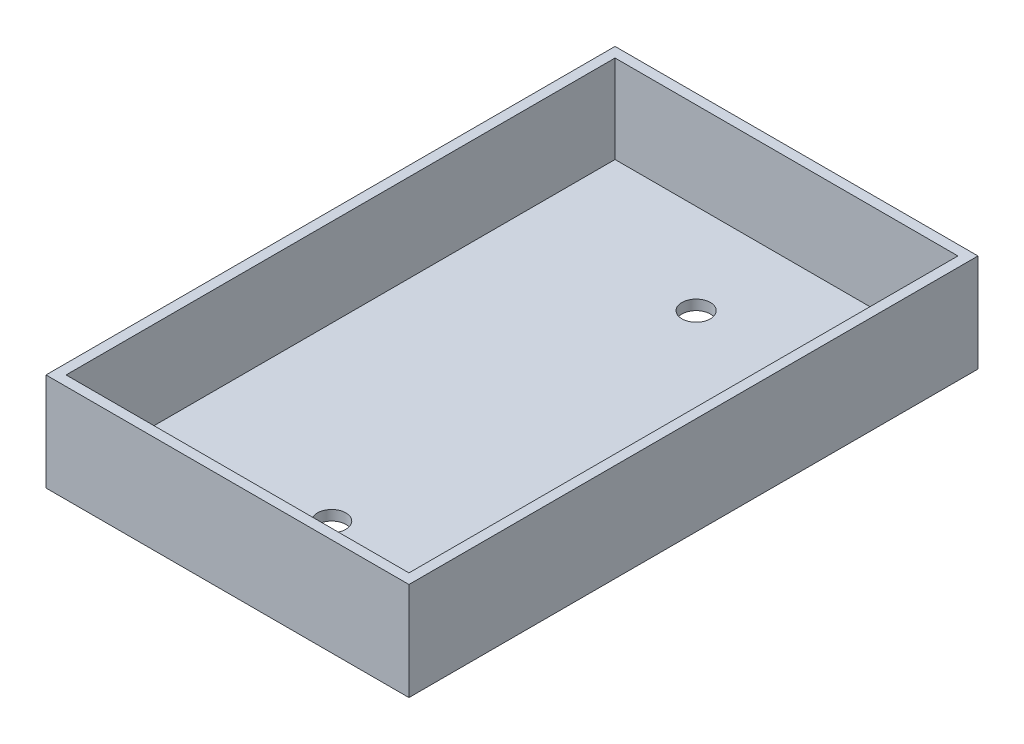
ISO-10303-21;
HEADER;
FILE_DESCRIPTION(('STEP AP214'),'2;1');
FILE_NAME('part.step','',(''),(''),'','','');
FILE_SCHEMA(('AUTOMOTIVE_DESIGN { 1 0 10303 214 1 1 1 1 }'));
ENDSEC;
DATA;
#1=APPLICATION_CONTEXT('core data for automotive mechanical design processes');
#2=APPLICATION_PROTOCOL_DEFINITION('international standard','automotive_design',2000,#1);
#3=PRODUCT_CONTEXT('',#1,'mechanical');
#4=PRODUCT('Part','Part','',(#3));
#5=PRODUCT_RELATED_PRODUCT_CATEGORY('part','',(#4));
#6=PRODUCT_DEFINITION_FORMATION('','',#4);
#7=PRODUCT_DEFINITION_CONTEXT('part definition',#1,'design');
#8=PRODUCT_DEFINITION('design','',#6,#7);
#9=PRODUCT_DEFINITION_SHAPE('','',#8);
#10=(LENGTH_UNIT() NAMED_UNIT(*) SI_UNIT(.MILLI.,.METRE.));
#11=(NAMED_UNIT(*) PLANE_ANGLE_UNIT() SI_UNIT($,.RADIAN.));
#12=(NAMED_UNIT(*) SI_UNIT($,.STERADIAN.) SOLID_ANGLE_UNIT());
#13=UNCERTAINTY_MEASURE_WITH_UNIT(LENGTH_MEASURE(1.E-05),#10,'distance_accuracy_value','');
#14=(GEOMETRIC_REPRESENTATION_CONTEXT(3) GLOBAL_UNCERTAINTY_ASSIGNED_CONTEXT((#13)) GLOBAL_UNIT_ASSIGNED_CONTEXT((#10,
#11,#12)) REPRESENTATION_CONTEXT('',''));
#15=CARTESIAN_POINT('',(0.,0.,0.));
#16=DIRECTION('',(0.,0.,1.));
#17=DIRECTION('',(1.,0.,0.));
#18=AXIS2_PLACEMENT_3D('',#15,#16,#17);
#19=CARTESIAN_POINT('',(0.,1.5875,0.));
#20=DIRECTION('',(0.,1.,0.));
#21=DIRECTION('',(0.,0.,1.));
#22=AXIS2_PLACEMENT_3D('',#19,#20,#21);
#23=PLANE('',#22);
#24=CARTESIAN_POINT('',(28.702,1.5875,73.5203));
#25=DIRECTION('',(0.,1.,0.));
#26=DIRECTION('',(0.,0.,1.));
#27=AXIS2_PLACEMENT_3D('',#24,#25,#26);
#28=CIRCLE('',#27,2.2479);
#29=CARTESIAN_POINT('',(28.702,1.5875,75.7682));
#30=VERTEX_POINT('',#29);
#31=EDGE_CURVE('E230',#30,#30,#28,.T.);
#32=ORIENTED_EDGE('',*,*,#31,.F.);
#33=EDGE_LOOP('',(#32));
#34=FACE_BOUND('',#33,.T.);
#35=CARTESIAN_POINT('',(28.702,1.5875,15.875));
#36=DIRECTION('',(0.,1.,0.));
#37=DIRECTION('',(0.,0.,1.));
#38=AXIS2_PLACEMENT_3D('',#35,#36,#37);
#39=CIRCLE('',#38,2.2479);
#40=CARTESIAN_POINT('',(28.702,1.5875,18.1229));
#41=VERTEX_POINT('',#40);
#42=EDGE_CURVE('E232',#41,#41,#39,.T.);
#43=ORIENTED_EDGE('',*,*,#42,.F.);
#44=EDGE_LOOP('',(#43));
#45=FACE_BOUND('',#44,.T.);
#46=DIRECTION('',(1.,0.,0.));
#47=VECTOR('',#46,1.);
#48=CARTESIAN_POINT('',(-13.996817441833,1.5875,1.58750000000001));
#49=LINE('',#48,#47);
#50=CARTESIAN_POINT('',(1.5875,1.5875,1.58750000000001));
#51=VERTEX_POINT('',#50);
#52=CARTESIAN_POINT('',(55.8165,1.5875,1.58750000000002));
#53=VERTEX_POINT('',#52);
#54=EDGE_CURVE('E151',#51,#53,#49,.T.);
#55=ORIENTED_EDGE('',*,*,#54,.F.);
#56=DIRECTION('',(0.,0.,1.));
#57=VECTOR('',#56,1.);
#58=CARTESIAN_POINT('',(1.5875,1.5875,0.));
#59=LINE('',#58,#57);
#60=CARTESIAN_POINT('',(1.58750000000001,1.5875,88.4125));
#61=VERTEX_POINT('',#60);
#62=EDGE_CURVE('E126',#51,#61,#59,.T.);
#63=ORIENTED_EDGE('',*,*,#62,.T.);
#64=DIRECTION('',(1.,0.,0.));
#65=VECTOR('',#64,1.);
#66=CARTESIAN_POINT('',(-13.996817441833,1.5875,88.4125));
#67=LINE('',#66,#65);
#68=CARTESIAN_POINT('',(55.8165,1.5875,88.4125));
#69=VERTEX_POINT('',#68);
#70=EDGE_CURVE('E140',#61,#69,#67,.T.);
#71=ORIENTED_EDGE('',*,*,#70,.T.);
#72=DIRECTION('',(0.,0.,-1.));
#73=VECTOR('',#72,1.);
#74=CARTESIAN_POINT('',(55.8165,1.5875,90.));
#75=LINE('',#74,#73);
#76=EDGE_CURVE('E63',#69,#53,#75,.T.);
#77=ORIENTED_EDGE('',*,*,#76,.T.);
#78=EDGE_LOOP('',(#55,#63,#71,#77));
#79=FACE_BOUND('',#78,.T.);
#80=ADVANCED_FACE('F41',(#34,#45,#79),#23,.T.);
#81=CARTESIAN_POINT('',(0.,1.5875,0.));
#82=DIRECTION('',(1.,0.,0.));
#83=DIRECTION('',(0.,0.,-1.));
#84=AXIS2_PLACEMENT_3D('',#81,#82,#83);
#85=PLANE('',#84);
#86=DIRECTION('',(0.,0.,1.));
#87=VECTOR('',#86,1.);
#88=CARTESIAN_POINT('',(0.,0.,0.));
#89=LINE('',#88,#87);
#90=CARTESIAN_POINT('',(0.,0.,0.));
#91=VERTEX_POINT('',#90);
#92=CARTESIAN_POINT('',(0.,0.,90.));
#93=VERTEX_POINT('',#92);
#94=EDGE_CURVE('E112',#91,#93,#89,.T.);
#95=ORIENTED_EDGE('',*,*,#94,.T.);
#96=DIRECTION('',(0.,-1.,0.));
#97=VECTOR('',#96,1.);
#98=CARTESIAN_POINT('',(0.,1.5875,90.));
#99=LINE('',#98,#97);
#100=CARTESIAN_POINT('',(0.,15.494,90.));
#101=VERTEX_POINT('',#100);
#102=EDGE_CURVE('E12',#101,#93,#99,.T.);
#103=ORIENTED_EDGE('',*,*,#102,.F.);
#104=DIRECTION('',(0.,0.,-1.));
#105=VECTOR('',#104,1.);
#106=CARTESIAN_POINT('',(0.,15.494,90.));
#107=LINE('',#106,#105);
#108=CARTESIAN_POINT('',(0.,15.494,0.));
#109=VERTEX_POINT('',#108);
#110=EDGE_CURVE('E110',#101,#109,#107,.T.);
#111=ORIENTED_EDGE('',*,*,#110,.T.);
#112=DIRECTION('',(0.,-1.,0.));
#113=VECTOR('',#112,1.);
#114=CARTESIAN_POINT('',(0.,1.5875,0.));
#115=LINE('',#114,#113);
#116=EDGE_CURVE('E168',#109,#91,#115,.T.);
#117=ORIENTED_EDGE('',*,*,#116,.T.);
#118=EDGE_LOOP('',(#95,#103,#111,#117));
#119=FACE_BOUND('',#118,.T.);
#120=ADVANCED_FACE('F43',(#119),#85,.F.);
#121=CARTESIAN_POINT('',(0.,1.5875,90.));
#122=DIRECTION('',(0.,0.,-1.));
#123=DIRECTION('',(-1.,0.,0.));
#124=AXIS2_PLACEMENT_3D('',#121,#122,#123);
#125=PLANE('',#124);
#126=DIRECTION('',(1.,0.,0.));
#127=VECTOR('',#126,1.);
#128=CARTESIAN_POINT('',(0.,0.,90.));
#129=LINE('',#128,#127);
#130=CARTESIAN_POINT('',(57.404,0.,90.));
#131=VERTEX_POINT('',#130);
#132=EDGE_CURVE('E162',#93,#131,#129,.T.);
#133=ORIENTED_EDGE('',*,*,#132,.T.);
#134=DIRECTION('',(0.,-1.,0.));
#135=VECTOR('',#134,1.);
#136=CARTESIAN_POINT('',(57.404,1.5875,90.));
#137=LINE('',#136,#135);
#138=CARTESIAN_POINT('',(57.404,15.494,90.));
#139=VERTEX_POINT('',#138);
#140=EDGE_CURVE('E49',#139,#131,#137,.T.);
#141=ORIENTED_EDGE('',*,*,#140,.F.);
#142=DIRECTION('',(1.,0.,0.));
#143=VECTOR('',#142,1.);
#144=CARTESIAN_POINT('',(55.8165,15.494,90.));
#145=LINE('',#144,#143);
#146=EDGE_CURVE('E115',#101,#139,#145,.T.);
#147=ORIENTED_EDGE('',*,*,#146,.F.);
#148=ORIENTED_EDGE('',*,*,#102,.T.);
#149=EDGE_LOOP('',(#133,#141,#147,#148));
#150=FACE_BOUND('',#149,.T.);
#151=ADVANCED_FACE('F116',(#150),#125,.F.);
#152=CARTESIAN_POINT('',(57.404,1.5875,0.));
#153=DIRECTION('',(-1.,0.,0.));
#154=DIRECTION('',(0.,0.,1.));
#155=AXIS2_PLACEMENT_3D('',#152,#153,#154);
#156=PLANE('',#155);
#157=DIRECTION('',(0.,0.,-1.));
#158=VECTOR('',#157,1.);
#159=CARTESIAN_POINT('',(57.404,0.,0.));
#160=LINE('',#159,#158);
#161=CARTESIAN_POINT('',(57.404,0.,0.));
#162=VERTEX_POINT('',#161);
#163=EDGE_CURVE('E164',#131,#162,#160,.T.);
#164=ORIENTED_EDGE('',*,*,#163,.T.);
#165=DIRECTION('',(0.,-1.,0.));
#166=VECTOR('',#165,1.);
#167=CARTESIAN_POINT('',(57.404,1.5875,0.));
#168=LINE('',#167,#166);
#169=CARTESIAN_POINT('',(57.404,15.494,0.));
#170=VERTEX_POINT('',#169);
#171=EDGE_CURVE('E170',#170,#162,#168,.T.);
#172=ORIENTED_EDGE('',*,*,#171,.F.);
#173=DIRECTION('',(0.,0.,1.));
#174=VECTOR('',#173,1.);
#175=CARTESIAN_POINT('',(57.404,15.494,90.));
#176=LINE('',#175,#174);
#177=EDGE_CURVE('E148',#170,#139,#176,.T.);
#178=ORIENTED_EDGE('',*,*,#177,.T.);
#179=ORIENTED_EDGE('',*,*,#140,.T.);
#180=EDGE_LOOP('',(#164,#172,#178,#179));
#181=FACE_BOUND('',#180,.T.);
#182=ADVANCED_FACE('F174',(#181),#156,.F.);
#183=CARTESIAN_POINT('',(0.,1.5875,0.));
#184=DIRECTION('',(0.,0.,1.));
#185=DIRECTION('',(1.,0.,0.));
#186=AXIS2_PLACEMENT_3D('',#183,#184,#185);
#187=PLANE('',#186);
#188=ORIENTED_EDGE('',*,*,#116,.F.);
#189=DIRECTION('',(1.,0.,0.));
#190=VECTOR('',#189,1.);
#191=CARTESIAN_POINT('',(55.8165,15.494,0.));
#192=LINE('',#191,#190);
#193=EDGE_CURVE('E121',#109,#170,#192,.T.);
#194=ORIENTED_EDGE('',*,*,#193,.T.);
#195=ORIENTED_EDGE('',*,*,#171,.T.);
#196=DIRECTION('',(-1.,0.,0.));
#197=VECTOR('',#196,1.);
#198=CARTESIAN_POINT('',(0.,0.,0.));
#199=LINE('',#198,#197);
#200=EDGE_CURVE('E166',#162,#91,#199,.T.);
#201=ORIENTED_EDGE('',*,*,#200,.T.);
#202=EDGE_LOOP('',(#188,#194,#195,#201));
#203=FACE_BOUND('',#202,.T.);
#204=ADVANCED_FACE('F179',(#203),#187,.F.);
#205=CARTESIAN_POINT('',(0.,0.,0.));
#206=DIRECTION('',(0.,1.,0.));
#207=DIRECTION('',(0.,0.,1.));
#208=AXIS2_PLACEMENT_3D('',#205,#206,#207);
#209=PLANE('',#208);
#210=CARTESIAN_POINT('',(28.702,0.,73.5203));
#211=DIRECTION('',(0.,1.,0.));
#212=DIRECTION('',(0.,0.,1.));
#213=AXIS2_PLACEMENT_3D('',#210,#211,#212);
#214=CIRCLE('',#213,2.2479);
#215=CARTESIAN_POINT('',(28.702,0.,75.7682));
#216=VERTEX_POINT('',#215);
#217=EDGE_CURVE('E228',#216,#216,#214,.T.);
#218=ORIENTED_EDGE('',*,*,#217,.T.);
#219=EDGE_LOOP('',(#218));
#220=FACE_BOUND('',#219,.T.);
#221=CARTESIAN_POINT('',(28.702,0.,15.875));
#222=DIRECTION('',(0.,1.,0.));
#223=DIRECTION('',(0.,0.,1.));
#224=AXIS2_PLACEMENT_3D('',#221,#222,#223);
#225=CIRCLE('',#224,2.2479);
#226=CARTESIAN_POINT('',(28.702,0.,18.1229));
#227=VERTEX_POINT('',#226);
#228=EDGE_CURVE('E132',#227,#227,#225,.T.);
#229=ORIENTED_EDGE('',*,*,#228,.T.);
#230=EDGE_LOOP('',(#229));
#231=FACE_BOUND('',#230,.T.);
#232=ORIENTED_EDGE('',*,*,#94,.F.);
#233=ORIENTED_EDGE('',*,*,#200,.F.);
#234=ORIENTED_EDGE('',*,*,#163,.F.);
#235=ORIENTED_EDGE('',*,*,#132,.F.);
#236=EDGE_LOOP('',(#232,#233,#234,#235));
#237=FACE_BOUND('',#236,.T.);
#238=ADVANCED_FACE('F177',(#220,#231,#237),#209,.F.);
#239=CARTESIAN_POINT('',(55.8165,15.494,90.));
#240=DIRECTION('',(0.,1.,0.));
#241=DIRECTION('',(0.,0.,1.));
#242=AXIS2_PLACEMENT_3D('',#239,#240,#241);
#243=PLANE('',#242);
#244=DIRECTION('',(0.,0.,-1.));
#245=VECTOR('',#244,1.);
#246=CARTESIAN_POINT('',(1.58750000000001,15.494,90.));
#247=LINE('',#246,#245);
#248=CARTESIAN_POINT('',(1.58750000000001,15.494,88.4125));
#249=VERTEX_POINT('',#248);
#250=CARTESIAN_POINT('',(1.5875,15.494,1.58750000000005));
#251=VERTEX_POINT('',#250);
#252=EDGE_CURVE('E127',#249,#251,#247,.T.);
#253=ORIENTED_EDGE('',*,*,#252,.T.);
#254=DIRECTION('',(1.,0.,0.));
#255=VECTOR('',#254,1.);
#256=CARTESIAN_POINT('',(-13.996817441833,15.494,1.58750000000001));
#257=LINE('',#256,#255);
#258=CARTESIAN_POINT('',(55.8165,15.494,1.5875));
#259=VERTEX_POINT('',#258);
#260=EDGE_CURVE('E149',#251,#259,#257,.T.);
#261=ORIENTED_EDGE('',*,*,#260,.T.);
#262=DIRECTION('',(0.,0.,1.));
#263=VECTOR('',#262,1.);
#264=CARTESIAN_POINT('',(55.8165,15.494,90.));
#265=LINE('',#264,#263);
#266=CARTESIAN_POINT('',(55.8165,15.494,88.4125));
#267=VERTEX_POINT('',#266);
#268=EDGE_CURVE('E157',#259,#267,#265,.T.);
#269=ORIENTED_EDGE('',*,*,#268,.T.);
#270=DIRECTION('',(1.,0.,0.));
#271=VECTOR('',#270,1.);
#272=CARTESIAN_POINT('',(-13.996817441833,15.494,88.4125));
#273=LINE('',#272,#271);
#274=EDGE_CURVE('E142',#249,#267,#273,.T.);
#275=ORIENTED_EDGE('',*,*,#274,.F.);
#276=EDGE_LOOP('',(#253,#261,#269,#275));
#277=FACE_BOUND('',#276,.T.);
#278=ORIENTED_EDGE('',*,*,#177,.F.);
#279=ORIENTED_EDGE('',*,*,#193,.F.);
#280=ORIENTED_EDGE('',*,*,#110,.F.);
#281=ORIENTED_EDGE('',*,*,#146,.T.);
#282=EDGE_LOOP('',(#278,#279,#280,#281));
#283=FACE_BOUND('',#282,.T.);
#284=ADVANCED_FACE('F124',(#277,#283),#243,.T.);
#285=CARTESIAN_POINT('',(55.8165,0.,0.));
#286=DIRECTION('',(-1.,0.,0.));
#287=DIRECTION('',(0.,0.,1.));
#288=AXIS2_PLACEMENT_3D('',#285,#286,#287);
#289=PLANE('',#288);
#290=DIRECTION('',(0.,1.,0.));
#291=VECTOR('',#290,1.);
#292=CARTESIAN_POINT('',(55.8165,0.,88.4125));
#293=LINE('',#292,#291);
#294=EDGE_CURVE('E56',#69,#267,#293,.T.);
#295=ORIENTED_EDGE('',*,*,#294,.T.);
#296=ORIENTED_EDGE('',*,*,#268,.F.);
#297=DIRECTION('',(0.,-1.,0.));
#298=VECTOR('',#297,1.);
#299=CARTESIAN_POINT('',(55.8165,0.,1.5875));
#300=LINE('',#299,#298);
#301=EDGE_CURVE('E139',#259,#53,#300,.T.);
#302=ORIENTED_EDGE('',*,*,#301,.T.);
#303=ORIENTED_EDGE('',*,*,#76,.F.);
#304=EDGE_LOOP('',(#295,#296,#302,#303));
#305=FACE_BOUND('',#304,.T.);
#306=ADVANCED_FACE('F200',(#305),#289,.T.);
#307=CARTESIAN_POINT('',(-13.996817441833,0.,1.58750000000002));
#308=DIRECTION('',(0.,0.,1.));
#309=DIRECTION('',(0.,-1.,0.));
#310=AXIS2_PLACEMENT_3D('',#307,#308,#309);
#311=PLANE('',#310);
#312=DIRECTION('',(0.,1.,0.));
#313=VECTOR('',#312,1.);
#314=CARTESIAN_POINT('',(1.5875,0.,1.58750000000001));
#315=LINE('',#314,#313);
#316=EDGE_CURVE('E146',#51,#251,#315,.T.);
#317=ORIENTED_EDGE('',*,*,#316,.F.);
#318=ORIENTED_EDGE('',*,*,#54,.T.);
#319=ORIENTED_EDGE('',*,*,#301,.F.);
#320=ORIENTED_EDGE('',*,*,#260,.F.);
#321=EDGE_LOOP('',(#317,#318,#319,#320));
#322=FACE_BOUND('',#321,.T.);
#323=ADVANCED_FACE('F204',(#322),#311,.T.);
#324=CARTESIAN_POINT('',(-13.996817441833,0.,88.4125));
#325=DIRECTION('',(0.,0.,-1.));
#326=DIRECTION('',(-1.,0.,0.));
#327=AXIS2_PLACEMENT_3D('',#324,#325,#326);
#328=PLANE('',#327);
#329=DIRECTION('',(0.,-1.,0.));
#330=VECTOR('',#329,1.);
#331=CARTESIAN_POINT('',(1.58750000000001,0.,88.4125));
#332=LINE('',#331,#330);
#333=EDGE_CURVE('E137',#249,#61,#332,.T.);
#334=ORIENTED_EDGE('',*,*,#333,.F.);
#335=ORIENTED_EDGE('',*,*,#274,.T.);
#336=ORIENTED_EDGE('',*,*,#294,.F.);
#337=ORIENTED_EDGE('',*,*,#70,.F.);
#338=EDGE_LOOP('',(#334,#335,#336,#337));
#339=FACE_BOUND('',#338,.T.);
#340=ADVANCED_FACE('F207',(#339),#328,.T.);
#341=CARTESIAN_POINT('',(1.5875,0.,0.));
#342=DIRECTION('',(-1.,0.,0.));
#343=DIRECTION('',(0.,0.,1.));
#344=AXIS2_PLACEMENT_3D('',#341,#342,#343);
#345=PLANE('',#344);
#346=ORIENTED_EDGE('',*,*,#62,.F.);
#347=ORIENTED_EDGE('',*,*,#316,.T.);
#348=ORIENTED_EDGE('',*,*,#252,.F.);
#349=ORIENTED_EDGE('',*,*,#333,.T.);
#350=EDGE_LOOP('',(#346,#347,#348,#349));
#351=FACE_BOUND('',#350,.T.);
#352=ADVANCED_FACE('F211',(#351),#345,.F.);
#353=CARTESIAN_POINT('',(28.702,1.5875,15.875));
#354=DIRECTION('',(0.,1.,0.));
#355=DIRECTION('',(0.,0.,1.));
#356=AXIS2_PLACEMENT_3D('',#353,#354,#355);
#357=CYLINDRICAL_SURFACE('',#356,2.2479);
#358=ORIENTED_EDGE('',*,*,#228,.F.);
#359=EDGE_LOOP('',(#358));
#360=FACE_BOUND('',#359,.T.);
#361=ORIENTED_EDGE('',*,*,#42,.T.);
#362=EDGE_LOOP('',(#361));
#363=FACE_BOUND('',#362,.T.);
#364=ADVANCED_FACE('F215',(#360,#363),#357,.F.);
#365=CARTESIAN_POINT('',(28.702,1.5875,73.5203));
#366=DIRECTION('',(0.,1.,0.));
#367=DIRECTION('',(0.,0.,1.));
#368=AXIS2_PLACEMENT_3D('',#365,#366,#367);
#369=CYLINDRICAL_SURFACE('',#368,2.2479);
#370=ORIENTED_EDGE('',*,*,#217,.F.);
#371=EDGE_LOOP('',(#370));
#372=FACE_BOUND('',#371,.T.);
#373=ORIENTED_EDGE('',*,*,#31,.T.);
#374=EDGE_LOOP('',(#373));
#375=FACE_BOUND('',#374,.T.);
#376=ADVANCED_FACE('F219',(#372,#375),#369,.F.);
#377=CLOSED_SHELL('',(#80,#120,#151,#182,#204,#238,#284,#306,#323,#340,#352,#364,#376));
#378=MANIFOLD_SOLID_BREP('B2',#377);
#379=ADVANCED_BREP_SHAPE_REPRESENTATION('',(#18,#378),#14);
#380=SHAPE_DEFINITION_REPRESENTATION(#9,#379);
ENDSEC;
END-ISO-10303-21;
